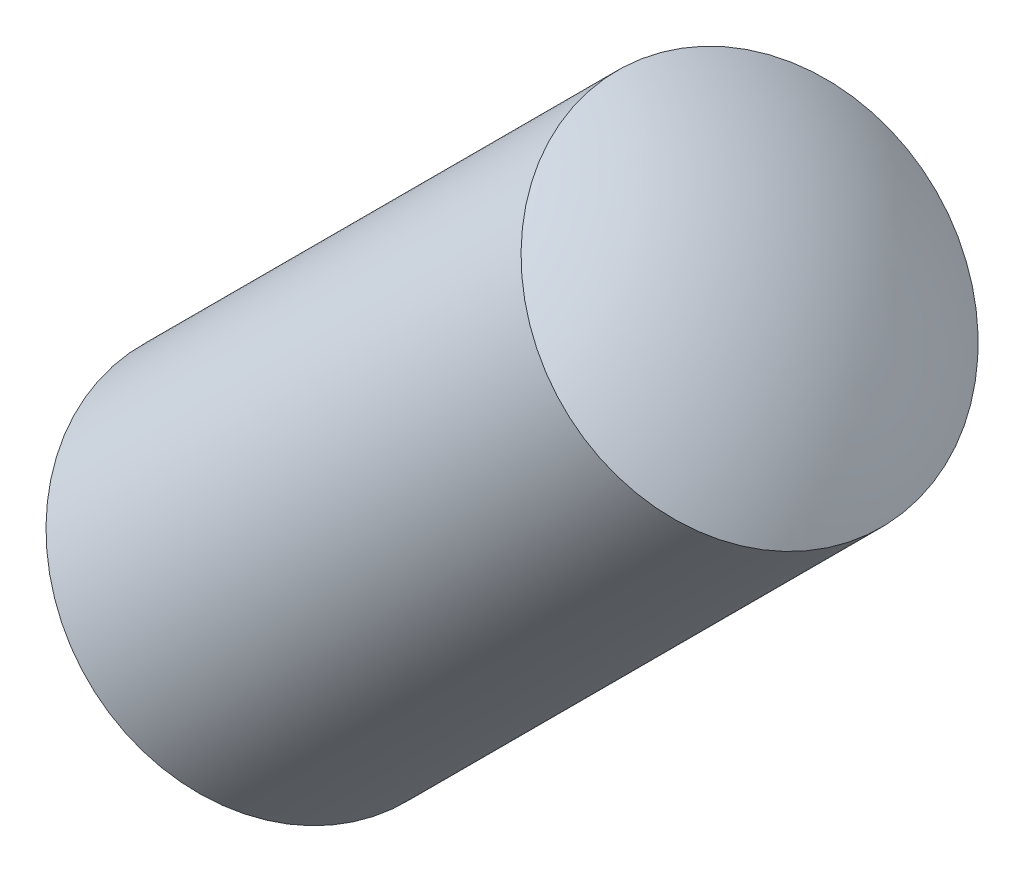
ISO-10303-21;
HEADER;
FILE_DESCRIPTION(('STEP AP214'),'2;1');
FILE_NAME('part.step','',(''),(''),'','','');
FILE_SCHEMA(('AUTOMOTIVE_DESIGN { 1 0 10303 214 1 1 1 1 }'));
ENDSEC;
DATA;
#1=APPLICATION_CONTEXT('core data for automotive mechanical design processes');
#2=APPLICATION_PROTOCOL_DEFINITION('international standard','automotive_design',2000,#1);
#3=PRODUCT_CONTEXT('',#1,'mechanical');
#4=PRODUCT('Part','Part','',(#3));
#5=PRODUCT_RELATED_PRODUCT_CATEGORY('part','',(#4));
#6=PRODUCT_DEFINITION_FORMATION('','',#4);
#7=PRODUCT_DEFINITION_CONTEXT('part definition',#1,'design');
#8=PRODUCT_DEFINITION('design','',#6,#7);
#9=PRODUCT_DEFINITION_SHAPE('','',#8);
#10=(LENGTH_UNIT() NAMED_UNIT(*) SI_UNIT(.MILLI.,.METRE.));
#11=(NAMED_UNIT(*) PLANE_ANGLE_UNIT() SI_UNIT($,.RADIAN.));
#12=(NAMED_UNIT(*) SI_UNIT($,.STERADIAN.) SOLID_ANGLE_UNIT());
#13=UNCERTAINTY_MEASURE_WITH_UNIT(LENGTH_MEASURE(1.E-05),#10,'distance_accuracy_value','');
#14=(GEOMETRIC_REPRESENTATION_CONTEXT(3) GLOBAL_UNCERTAINTY_ASSIGNED_CONTEXT((#13)) GLOBAL_UNIT_ASSIGNED_CONTEXT((#10,
#11,#12)) REPRESENTATION_CONTEXT('',''));
#15=CARTESIAN_POINT('',(0.,0.,0.));
#16=DIRECTION('',(0.,0.,1.));
#17=DIRECTION('',(1.,0.,0.));
#18=AXIS2_PLACEMENT_3D('',#15,#16,#17);
#19=CARTESIAN_POINT('',(19.5175074847463,19.5175074847464,0.9));
#20=DIRECTION('',(0.707106781186548,-0.707106781186547,0.));
#21=DIRECTION('',(0.707106781186547,0.707106781186548,0.));
#22=AXIS2_PLACEMENT_3D('',#19,#20,#21);
#23=SPHERICAL_SURFACE('',#22,3.);
#24=CARTESIAN_POINT('',(19.5175074847463,19.5175074847464,0.9));
#25=DIRECTION('',(-0.707106781186547,-0.707106781186548,0.));
#26=DIRECTION('',(0.,0.,-1.));
#27=AXIS2_PLACEMENT_3D('',#24,#25,#26);
#28=SPHERICAL_SURFACE('',#27,3.);
#29=CARTESIAN_POINT('',(21.3546247918337,21.3546247918337,0.9));
#30=DIRECTION('',(-0.707106781186547,-0.707106781186548,0.));
#31=DIRECTION('',(0.,0.,-1.));
#32=AXIS2_PLACEMENT_3D('',#29,#30,#31);
#33=CIRCLE('',#32,1.5);
#34=CARTESIAN_POINT('',(21.3546247918337,21.3546247918337,-0.6));
#35=VERTEX_POINT('',#34);
#36=EDGE_CURVE('E11',#35,#35,#33,.T.);
#37=ORIENTED_EDGE('',*,*,#36,.F.);
#38=EDGE_LOOP('',(#37));
#39=FACE_BOUND('',#38,.T.);
#40=ADVANCED_FACE('F17',(#39),#28,.T.);
#41=CARTESIAN_POINT('',(19.3733654805138,19.3733654805139,0.9));
#42=DIRECTION('',(0.707106781186548,-0.707106781186548,0.));
#43=DIRECTION('',(-0.707106781186548,-0.707106781186548,0.));
#44=AXIS2_PLACEMENT_3D('',#41,#42,#43);
#45=SPHERICAL_SURFACE('',#44,3.);
#46=CARTESIAN_POINT('',(19.3733654805138,19.3733654805139,0.9));
#47=DIRECTION('',(-0.707106781186547,-0.707106781186548,0.));
#48=DIRECTION('',(0.,0.,-1.));
#49=AXIS2_PLACEMENT_3D('',#46,#47,#48);
#50=SPHERICAL_SURFACE('',#49,3.);
#51=CARTESIAN_POINT('',(17.5362481734264,17.5362481734264,0.9));
#52=DIRECTION('',(-0.707106781186547,-0.707106781186548,0.));
#53=DIRECTION('',(0.,0.,-1.));
#54=AXIS2_PLACEMENT_3D('',#51,#52,#53);
#55=CIRCLE('',#54,1.5);
#56=CARTESIAN_POINT('',(17.5362481734264,17.5362481734264,-0.6));
#57=VERTEX_POINT('',#56);
#58=EDGE_CURVE('E25',#57,#57,#55,.T.);
#59=ORIENTED_EDGE('',*,*,#58,.T.);
#60=EDGE_LOOP('',(#59));
#61=FACE_BOUND('',#60,.T.);
#62=ADVANCED_FACE('F39',(#61),#50,.T.);
#63=CARTESIAN_POINT('',(18.4908423280282,18.4908423280282,0.9));
#64=DIRECTION('',(-0.707106781186547,-0.707106781186548,0.));
#65=DIRECTION('',(0.,0.,-1.));
#66=AXIS2_PLACEMENT_3D('',#63,#64,#65);
#67=CYLINDRICAL_SURFACE('',#66,1.5);
#68=ORIENTED_EDGE('',*,*,#36,.T.);
#69=EDGE_LOOP('',(#68));
#70=FACE_BOUND('',#69,.T.);
#71=ORIENTED_EDGE('',*,*,#58,.F.);
#72=EDGE_LOOP('',(#71));
#73=FACE_BOUND('',#72,.T.);
#74=ADVANCED_FACE('F47',(#70,#73),#67,.T.);
#75=CLOSED_SHELL('',(#40,#62,#74));
#76=MANIFOLD_SOLID_BREP('B1',#75);
#77=ADVANCED_BREP_SHAPE_REPRESENTATION('',(#18,#76),#14);
#78=SHAPE_DEFINITION_REPRESENTATION(#9,#77);
ENDSEC;
END-ISO-10303-21;
